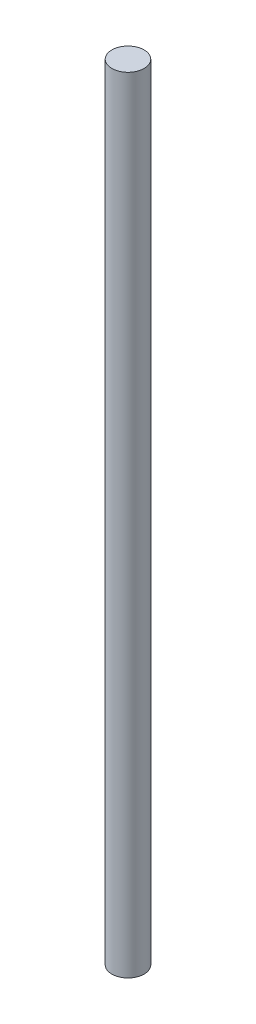
ISO-10303-21;
HEADER;
FILE_DESCRIPTION(('STEP AP214'),'2;1');
FILE_NAME('part.step','',(''),(''),'','','');
FILE_SCHEMA(('AUTOMOTIVE_DESIGN { 1 0 10303 214 1 1 1 1 }'));
ENDSEC;
DATA;
#1=APPLICATION_CONTEXT('core data for automotive mechanical design processes');
#2=APPLICATION_PROTOCOL_DEFINITION('international standard','automotive_design',2000,#1);
#3=PRODUCT_CONTEXT('',#1,'mechanical');
#4=PRODUCT('Part','Part','',(#3));
#5=PRODUCT_RELATED_PRODUCT_CATEGORY('part','',(#4));
#6=PRODUCT_DEFINITION_FORMATION('','',#4);
#7=PRODUCT_DEFINITION_CONTEXT('part definition',#1,'design');
#8=PRODUCT_DEFINITION('design','',#6,#7);
#9=PRODUCT_DEFINITION_SHAPE('','',#8);
#10=(LENGTH_UNIT() NAMED_UNIT(*) SI_UNIT(.MILLI.,.METRE.));
#11=(NAMED_UNIT(*) PLANE_ANGLE_UNIT() SI_UNIT($,.RADIAN.));
#12=(NAMED_UNIT(*) SI_UNIT($,.STERADIAN.) SOLID_ANGLE_UNIT());
#13=UNCERTAINTY_MEASURE_WITH_UNIT(LENGTH_MEASURE(1.E-05),#10,'distance_accuracy_value','');
#14=(GEOMETRIC_REPRESENTATION_CONTEXT(3) GLOBAL_UNCERTAINTY_ASSIGNED_CONTEXT((#13)) GLOBAL_UNIT_ASSIGNED_CONTEXT((#10,
#11,#12)) REPRESENTATION_CONTEXT('',''));
#15=CARTESIAN_POINT('',(0.,0.,0.));
#16=DIRECTION('',(0.,0.,1.));
#17=DIRECTION('',(1.,0.,0.));
#18=AXIS2_PLACEMENT_3D('',#15,#16,#17);
#19=CARTESIAN_POINT('',(0.,146.,0.));
#20=DIRECTION('',(0.,-1.,0.));
#21=DIRECTION('',(0.,0.,-1.));
#22=AXIS2_PLACEMENT_3D('',#19,#20,#21);
#23=CYLINDRICAL_SURFACE('',#22,3.);
#24=CARTESIAN_POINT('',(0.,146.,0.));
#25=DIRECTION('',(0.,1.,0.));
#26=DIRECTION('',(0.,0.,1.));
#27=AXIS2_PLACEMENT_3D('',#24,#25,#26);
#28=CIRCLE('',#27,3.);
#29=CARTESIAN_POINT('',(0.,146.,3.));
#30=VERTEX_POINT('',#29);
#31=EDGE_CURVE('E10',#30,#30,#28,.T.);
#32=ORIENTED_EDGE('',*,*,#31,.F.);
#33=EDGE_LOOP('',(#32));
#34=FACE_BOUND('',#33,.T.);
#35=CARTESIAN_POINT('',(0.,0.,0.));
#36=DIRECTION('',(0.,1.,0.));
#37=DIRECTION('',(0.,0.,1.));
#38=AXIS2_PLACEMENT_3D('',#35,#36,#37);
#39=CIRCLE('',#38,3.);
#40=CARTESIAN_POINT('',(0.,0.,3.));
#41=VERTEX_POINT('',#40);
#42=EDGE_CURVE('E42',#41,#41,#39,.T.);
#43=ORIENTED_EDGE('',*,*,#42,.T.);
#44=EDGE_LOOP('',(#43));
#45=FACE_BOUND('',#44,.T.);
#46=ADVANCED_FACE('F39',(#34,#45),#23,.T.);
#47=CARTESIAN_POINT('',(0.,146.,0.));
#48=DIRECTION('',(0.,1.,0.));
#49=DIRECTION('',(0.,0.,1.));
#50=AXIS2_PLACEMENT_3D('',#47,#48,#49);
#51=PLANE('',#50);
#52=ORIENTED_EDGE('',*,*,#31,.T.);
#53=EDGE_LOOP('',(#52));
#54=FACE_BOUND('',#53,.T.);
#55=ADVANCED_FACE('F54',(#54),#51,.T.);
#56=CARTESIAN_POINT('',(0.,0.,0.));
#57=DIRECTION('',(0.,1.,0.));
#58=DIRECTION('',(0.,0.,1.));
#59=AXIS2_PLACEMENT_3D('',#56,#57,#58);
#60=PLANE('',#59);
#61=ORIENTED_EDGE('',*,*,#42,.F.);
#62=EDGE_LOOP('',(#61));
#63=FACE_BOUND('',#62,.T.);
#64=ADVANCED_FACE('F52',(#63),#60,.F.);
#65=CLOSED_SHELL('',(#46,#55,#64));
#66=MANIFOLD_SOLID_BREP('B2',#65);
#67=ADVANCED_BREP_SHAPE_REPRESENTATION('',(#18,#66),#14);
#68=SHAPE_DEFINITION_REPRESENTATION(#9,#67);
ENDSEC;
END-ISO-10303-21;
